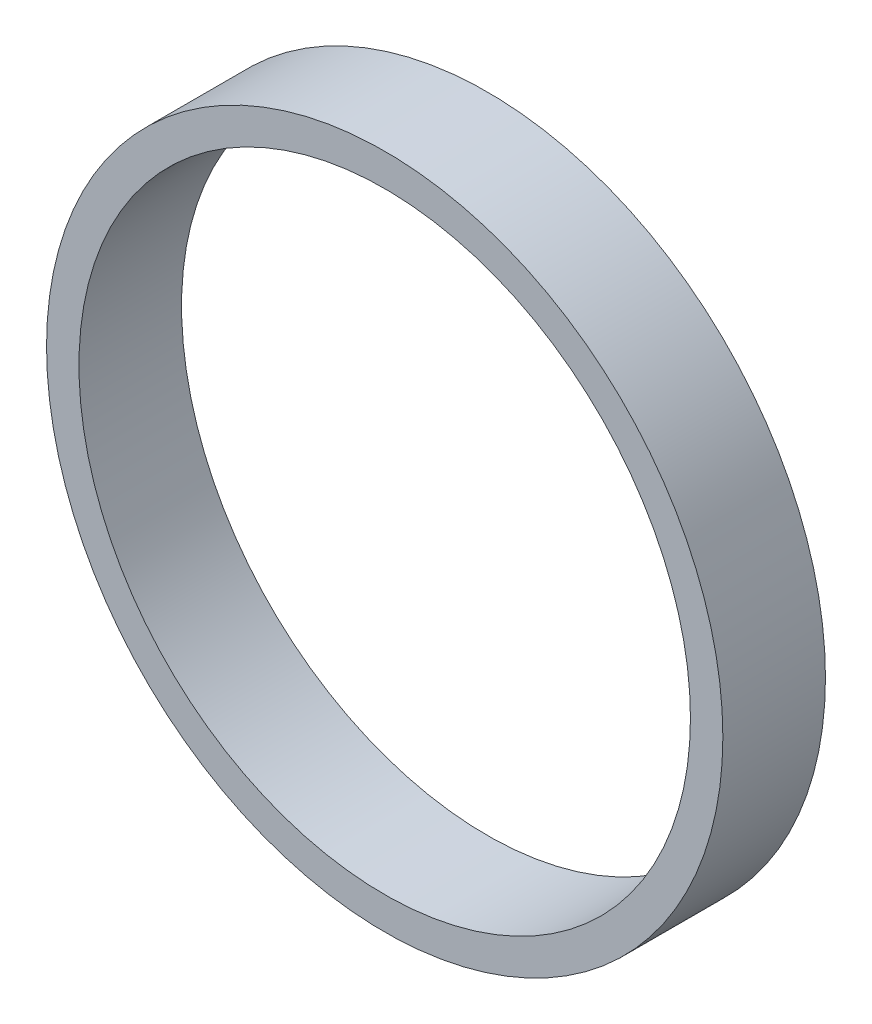
ISO-10303-21;
HEADER;
FILE_DESCRIPTION(('STEP AP214'),'2;1');
FILE_NAME('part.step','',(''),(''),'','','');
FILE_SCHEMA(('AUTOMOTIVE_DESIGN { 1 0 10303 214 1 1 1 1 }'));
ENDSEC;
DATA;
#1=APPLICATION_CONTEXT('core data for automotive mechanical design processes');
#2=APPLICATION_PROTOCOL_DEFINITION('international standard','automotive_design',2000,#1);
#3=PRODUCT_CONTEXT('',#1,'mechanical');
#4=PRODUCT('Part','Part','',(#3));
#5=PRODUCT_RELATED_PRODUCT_CATEGORY('part','',(#4));
#6=PRODUCT_DEFINITION_FORMATION('','',#4);
#7=PRODUCT_DEFINITION_CONTEXT('part definition',#1,'design');
#8=PRODUCT_DEFINITION('design','',#6,#7);
#9=PRODUCT_DEFINITION_SHAPE('','',#8);
#10=(LENGTH_UNIT() NAMED_UNIT(*) SI_UNIT(.MILLI.,.METRE.));
#11=(NAMED_UNIT(*) PLANE_ANGLE_UNIT() SI_UNIT($,.RADIAN.));
#12=(NAMED_UNIT(*) SI_UNIT($,.STERADIAN.) SOLID_ANGLE_UNIT());
#13=UNCERTAINTY_MEASURE_WITH_UNIT(LENGTH_MEASURE(1.E-05),#10,'distance_accuracy_value','');
#14=(GEOMETRIC_REPRESENTATION_CONTEXT(3) GLOBAL_UNCERTAINTY_ASSIGNED_CONTEXT((#13)) GLOBAL_UNIT_ASSIGNED_CONTEXT((#10,
#11,#12)) REPRESENTATION_CONTEXT('',''));
#15=CARTESIAN_POINT('',(0.,0.,0.));
#16=DIRECTION('',(0.,0.,1.));
#17=DIRECTION('',(1.,0.,0.));
#18=AXIS2_PLACEMENT_3D('',#15,#16,#17);
#19=CARTESIAN_POINT('',(0.,0.,19.05));
#20=DIRECTION('',(0.,0.,1.));
#21=DIRECTION('',(1.,0.,0.));
#22=AXIS2_PLACEMENT_3D('',#19,#20,#21);
#23=PLANE('',#22);
#24=CARTESIAN_POINT('',(0.,0.,19.05));
#25=DIRECTION('',(0.,0.,1.));
#26=DIRECTION('',(1.,0.,0.));
#27=AXIS2_PLACEMENT_3D('',#24,#25,#26);
#28=CIRCLE('',#27,62.7888);
#29=CARTESIAN_POINT('',(62.7888,0.,19.05));
#30=VERTEX_POINT('',#29);
#31=EDGE_CURVE('E10',#30,#30,#28,.T.);
#32=ORIENTED_EDGE('',*,*,#31,.T.);
#33=EDGE_LOOP('',(#32));
#34=FACE_BOUND('',#33,.T.);
#35=CARTESIAN_POINT('',(0.,0.,19.05));
#36=DIRECTION('',(0.,0.,1.));
#37=DIRECTION('',(1.,0.,0.));
#38=AXIS2_PLACEMENT_3D('',#35,#36,#37);
#39=CIRCLE('',#38,56.769);
#40=CARTESIAN_POINT('',(56.769,0.,19.05));
#41=VERTEX_POINT('',#40);
#42=EDGE_CURVE('E44',#41,#41,#39,.T.);
#43=ORIENTED_EDGE('',*,*,#42,.F.);
#44=EDGE_LOOP('',(#43));
#45=FACE_BOUND('',#44,.T.);
#46=ADVANCED_FACE('F33',(#34,#45),#23,.T.);
#47=CARTESIAN_POINT('',(0.,0.,0.));
#48=DIRECTION('',(0.,0.,1.));
#49=DIRECTION('',(1.,0.,0.));
#50=AXIS2_PLACEMENT_3D('',#47,#48,#49);
#51=PLANE('',#50);
#52=CARTESIAN_POINT('',(0.,0.,0.));
#53=DIRECTION('',(0.,0.,1.));
#54=DIRECTION('',(1.,0.,0.));
#55=AXIS2_PLACEMENT_3D('',#52,#53,#54);
#56=CIRCLE('',#55,62.7888);
#57=CARTESIAN_POINT('',(62.7888,0.,0.));
#58=VERTEX_POINT('',#57);
#59=EDGE_CURVE('E37',#58,#58,#56,.T.);
#60=ORIENTED_EDGE('',*,*,#59,.F.);
#61=EDGE_LOOP('',(#60));
#62=FACE_BOUND('',#61,.T.);
#63=CARTESIAN_POINT('',(0.,0.,0.));
#64=DIRECTION('',(0.,0.,1.));
#65=DIRECTION('',(1.,0.,0.));
#66=AXIS2_PLACEMENT_3D('',#63,#64,#65);
#67=CIRCLE('',#66,56.769);
#68=CARTESIAN_POINT('',(56.769,0.,0.));
#69=VERTEX_POINT('',#68);
#70=EDGE_CURVE('E46',#69,#69,#67,.T.);
#71=ORIENTED_EDGE('',*,*,#70,.T.);
#72=EDGE_LOOP('',(#71));
#73=FACE_BOUND('',#72,.T.);
#74=ADVANCED_FACE('F56',(#62,#73),#51,.F.);
#75=CARTESIAN_POINT('',(0.,0.,19.05));
#76=DIRECTION('',(0.,0.,-1.));
#77=DIRECTION('',(-1.,0.,0.));
#78=AXIS2_PLACEMENT_3D('',#75,#76,#77);
#79=CYLINDRICAL_SURFACE('',#78,62.7888);
#80=ORIENTED_EDGE('',*,*,#31,.F.);
#81=EDGE_LOOP('',(#80));
#82=FACE_BOUND('',#81,.T.);
#83=ORIENTED_EDGE('',*,*,#59,.T.);
#84=EDGE_LOOP('',(#83));
#85=FACE_BOUND('',#84,.T.);
#86=ADVANCED_FACE('F35',(#82,#85),#79,.T.);
#87=CARTESIAN_POINT('',(0.,0.,19.05));
#88=DIRECTION('',(0.,0.,-1.));
#89=DIRECTION('',(-1.,0.,0.));
#90=AXIS2_PLACEMENT_3D('',#87,#88,#89);
#91=CYLINDRICAL_SURFACE('',#90,56.769);
#92=ORIENTED_EDGE('',*,*,#42,.T.);
#93=EDGE_LOOP('',(#92));
#94=FACE_BOUND('',#93,.T.);
#95=ORIENTED_EDGE('',*,*,#70,.F.);
#96=EDGE_LOOP('',(#95));
#97=FACE_BOUND('',#96,.T.);
#98=ADVANCED_FACE('F52',(#94,#97),#91,.F.);
#99=CLOSED_SHELL('',(#46,#74,#86,#98));
#100=MANIFOLD_SOLID_BREP('B2',#99);
#101=ADVANCED_BREP_SHAPE_REPRESENTATION('',(#18,#100),#14);
#102=SHAPE_DEFINITION_REPRESENTATION(#9,#101);
ENDSEC;
END-ISO-10303-21;
